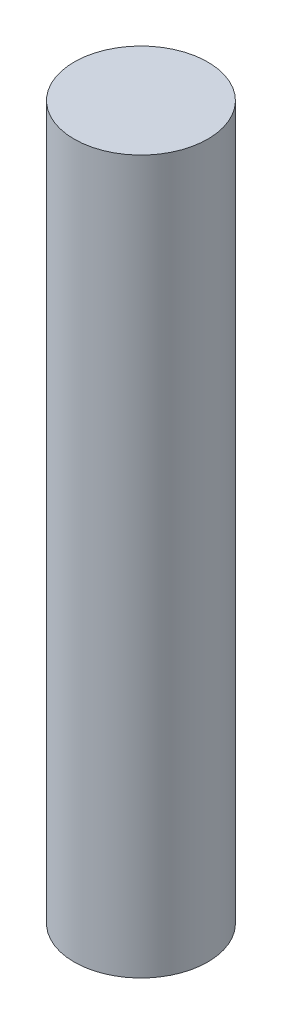
ISO-10303-21;
HEADER;
FILE_DESCRIPTION(('STEP AP214'),'2;1');
FILE_NAME('part.step','',(''),(''),'','','');
FILE_SCHEMA(('AUTOMOTIVE_DESIGN { 1 0 10303 214 1 1 1 1 }'));
ENDSEC;
DATA;
#1=APPLICATION_CONTEXT('core data for automotive mechanical design processes');
#2=APPLICATION_PROTOCOL_DEFINITION('international standard','automotive_design',2000,#1);
#3=PRODUCT_CONTEXT('',#1,'mechanical');
#4=PRODUCT('Part','Part','',(#3));
#5=PRODUCT_RELATED_PRODUCT_CATEGORY('part','',(#4));
#6=PRODUCT_DEFINITION_FORMATION('','',#4);
#7=PRODUCT_DEFINITION_CONTEXT('part definition',#1,'design');
#8=PRODUCT_DEFINITION('design','',#6,#7);
#9=PRODUCT_DEFINITION_SHAPE('','',#8);
#10=(LENGTH_UNIT() NAMED_UNIT(*) SI_UNIT(.MILLI.,.METRE.));
#11=(NAMED_UNIT(*) PLANE_ANGLE_UNIT() SI_UNIT($,.RADIAN.));
#12=(NAMED_UNIT(*) SI_UNIT($,.STERADIAN.) SOLID_ANGLE_UNIT());
#13=UNCERTAINTY_MEASURE_WITH_UNIT(LENGTH_MEASURE(1.E-05),#10,'distance_accuracy_value','');
#14=(GEOMETRIC_REPRESENTATION_CONTEXT(3) GLOBAL_UNCERTAINTY_ASSIGNED_CONTEXT((#13)) GLOBAL_UNIT_ASSIGNED_CONTEXT((#10,
#11,#12)) REPRESENTATION_CONTEXT('',''));
#15=CARTESIAN_POINT('',(0.,0.,0.));
#16=DIRECTION('',(0.,0.,1.));
#17=DIRECTION('',(1.,0.,0.));
#18=AXIS2_PLACEMENT_3D('',#15,#16,#17);
#19=CARTESIAN_POINT('',(0.,8.,0.));
#20=DIRECTION('',(0.,-1.,0.));
#21=DIRECTION('',(0.,0.,-1.));
#22=AXIS2_PLACEMENT_3D('',#19,#20,#21);
#23=CYLINDRICAL_SURFACE('',#22,0.750000000000001);
#24=CARTESIAN_POINT('',(0.,8.,0.));
#25=DIRECTION('',(0.,1.,0.));
#26=DIRECTION('',(0.,0.,1.));
#27=AXIS2_PLACEMENT_3D('',#24,#25,#26);
#28=CIRCLE('',#27,0.750000000000001);
#29=CARTESIAN_POINT('',(0.,8.,0.750000000000001));
#30=VERTEX_POINT('',#29);
#31=EDGE_CURVE('E10',#30,#30,#28,.T.);
#32=ORIENTED_EDGE('',*,*,#31,.F.);
#33=EDGE_LOOP('',(#32));
#34=FACE_BOUND('',#33,.T.);
#35=CARTESIAN_POINT('',(0.,0.,0.));
#36=DIRECTION('',(0.,1.,0.));
#37=DIRECTION('',(0.,0.,1.));
#38=AXIS2_PLACEMENT_3D('',#35,#36,#37);
#39=CIRCLE('',#38,0.750000000000001);
#40=CARTESIAN_POINT('',(0.,0.,0.750000000000001));
#41=VERTEX_POINT('',#40);
#42=EDGE_CURVE('E32',#41,#41,#39,.T.);
#43=ORIENTED_EDGE('',*,*,#42,.T.);
#44=EDGE_LOOP('',(#43));
#45=FACE_BOUND('',#44,.T.);
#46=ADVANCED_FACE('F29',(#34,#45),#23,.T.);
#47=CARTESIAN_POINT('',(0.,8.,0.));
#48=DIRECTION('',(0.,1.,0.));
#49=DIRECTION('',(0.,0.,1.));
#50=AXIS2_PLACEMENT_3D('',#47,#48,#49);
#51=PLANE('',#50);
#52=ORIENTED_EDGE('',*,*,#31,.T.);
#53=EDGE_LOOP('',(#52));
#54=FACE_BOUND('',#53,.T.);
#55=ADVANCED_FACE('F44',(#54),#51,.T.);
#56=CARTESIAN_POINT('',(0.,0.,0.));
#57=DIRECTION('',(0.,1.,0.));
#58=DIRECTION('',(0.,0.,1.));
#59=AXIS2_PLACEMENT_3D('',#56,#57,#58);
#60=PLANE('',#59);
#61=ORIENTED_EDGE('',*,*,#42,.F.);
#62=EDGE_LOOP('',(#61));
#63=FACE_BOUND('',#62,.T.);
#64=ADVANCED_FACE('F42',(#63),#60,.F.);
#65=CLOSED_SHELL('',(#46,#55,#64));
#66=MANIFOLD_SOLID_BREP('B2',#65);
#67=ADVANCED_BREP_SHAPE_REPRESENTATION('',(#18,#66),#14);
#68=SHAPE_DEFINITION_REPRESENTATION(#9,#67);
ENDSEC;
END-ISO-10303-21;
